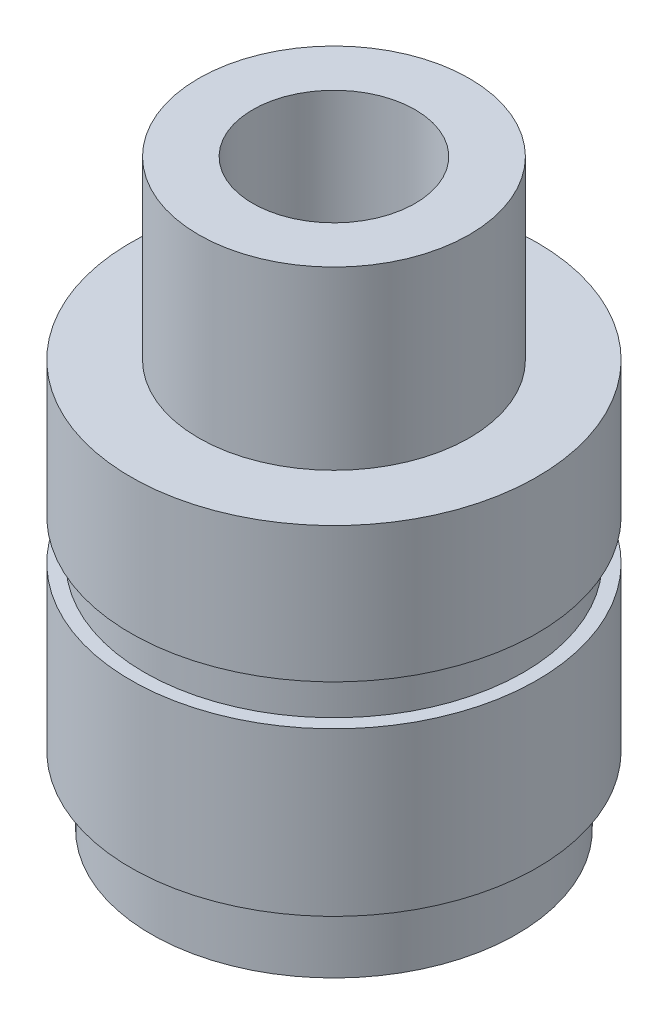
ISO-10303-21;
HEADER;
FILE_DESCRIPTION(('STEP AP214'),'2;1');
FILE_NAME('part.step','',(''),(''),'','','');
FILE_SCHEMA(('AUTOMOTIVE_DESIGN { 1 0 10303 214 1 1 1 1 }'));
ENDSEC;
DATA;
#1=APPLICATION_CONTEXT('core data for automotive mechanical design processes');
#2=APPLICATION_PROTOCOL_DEFINITION('international standard','automotive_design',2000,#1);
#3=PRODUCT_CONTEXT('',#1,'mechanical');
#4=PRODUCT('Part','Part','',(#3));
#5=PRODUCT_RELATED_PRODUCT_CATEGORY('part','',(#4));
#6=PRODUCT_DEFINITION_FORMATION('','',#4);
#7=PRODUCT_DEFINITION_CONTEXT('part definition',#1,'design');
#8=PRODUCT_DEFINITION('design','',#6,#7);
#9=PRODUCT_DEFINITION_SHAPE('','',#8);
#10=(LENGTH_UNIT() NAMED_UNIT(*) SI_UNIT(.MILLI.,.METRE.));
#11=(NAMED_UNIT(*) PLANE_ANGLE_UNIT() SI_UNIT($,.RADIAN.));
#12=(NAMED_UNIT(*) SI_UNIT($,.STERADIAN.) SOLID_ANGLE_UNIT());
#13=UNCERTAINTY_MEASURE_WITH_UNIT(LENGTH_MEASURE(1.E-05),#10,'distance_accuracy_value','');
#14=(GEOMETRIC_REPRESENTATION_CONTEXT(3) GLOBAL_UNCERTAINTY_ASSIGNED_CONTEXT((#13)) GLOBAL_UNIT_ASSIGNED_CONTEXT((#10,
#11,#12)) REPRESENTATION_CONTEXT('',''));
#15=CARTESIAN_POINT('',(0.,0.,0.));
#16=DIRECTION('',(0.,0.,1.));
#17=DIRECTION('',(1.,0.,0.));
#18=AXIS2_PLACEMENT_3D('',#15,#16,#17);
#19=CARTESIAN_POINT('',(13.5,0.,0.));
#20=DIRECTION('',(0.,-1.,0.));
#21=DIRECTION('',(0.,0.,-1.));
#22=AXIS2_PLACEMENT_3D('',#19,#20,#21);
#23=PLANE('',#22);
#24=CARTESIAN_POINT('',(0.,0.,0.));
#25=DIRECTION('',(0.,-1.,0.));
#26=DIRECTION('',(0.,0.,-1.));
#27=AXIS2_PLACEMENT_3D('',#24,#25,#26);
#28=CIRCLE('',#27,13.5);
#29=CARTESIAN_POINT('',(0.,0.,-13.5));
#30=VERTEX_POINT('',#29);
#31=EDGE_CURVE('E83',#30,#30,#28,.T.);
#32=ORIENTED_EDGE('',*,*,#31,.T.);
#33=EDGE_LOOP('',(#32));
#34=FACE_BOUND('',#33,.T.);
#35=CARTESIAN_POINT('',(0.,0.,0.));
#36=DIRECTION('',(0.,-1.,0.));
#37=DIRECTION('',(0.,0.,-1.));
#38=AXIS2_PLACEMENT_3D('',#35,#36,#37);
#39=CIRCLE('',#38,12.);
#40=CARTESIAN_POINT('',(0.,0.,-12.));
#41=VERTEX_POINT('',#40);
#42=EDGE_CURVE('E10',#41,#41,#39,.T.);
#43=ORIENTED_EDGE('',*,*,#42,.F.);
#44=EDGE_LOOP('',(#43));
#45=FACE_BOUND('',#44,.T.);
#46=ADVANCED_FACE('F37',(#34,#45),#23,.T.);
#47=CARTESIAN_POINT('',(0.,0.,0.));
#48=DIRECTION('',(0.,-1.,0.));
#49=DIRECTION('',(0.,0.,-1.));
#50=AXIS2_PLACEMENT_3D('',#47,#48,#49);
#51=CYLINDRICAL_SURFACE('',#50,12.);
#52=ORIENTED_EDGE('',*,*,#42,.T.);
#53=EDGE_LOOP('',(#52));
#54=FACE_BOUND('',#53,.T.);
#55=CARTESIAN_POINT('',(0.,25.,0.));
#56=DIRECTION('',(0.,-1.,0.));
#57=DIRECTION('',(0.,0.,-1.));
#58=AXIS2_PLACEMENT_3D('',#55,#56,#57);
#59=CIRCLE('',#58,12.);
#60=CARTESIAN_POINT('',(0.,25.,-12.));
#61=VERTEX_POINT('',#60);
#62=EDGE_CURVE('E43',#61,#61,#59,.T.);
#63=ORIENTED_EDGE('',*,*,#62,.F.);
#64=EDGE_LOOP('',(#63));
#65=FACE_BOUND('',#64,.T.);
#66=ADVANCED_FACE('F101',(#54,#65),#51,.F.);
#67=CARTESIAN_POINT('',(12.,25.,0.));
#68=DIRECTION('',(0.,-1.,0.));
#69=DIRECTION('',(0.,0.,-1.));
#70=AXIS2_PLACEMENT_3D('',#67,#68,#69);
#71=PLANE('',#70);
#72=ORIENTED_EDGE('',*,*,#62,.T.);
#73=EDGE_LOOP('',(#72));
#74=FACE_BOUND('',#73,.T.);
#75=CARTESIAN_POINT('',(0.,25.,0.));
#76=DIRECTION('',(0.,-1.,0.));
#77=DIRECTION('',(0.,0.,-1.));
#78=AXIS2_PLACEMENT_3D('',#75,#76,#77);
#79=CIRCLE('',#78,6.);
#80=CARTESIAN_POINT('',(0.,25.,-6.));
#81=VERTEX_POINT('',#80);
#82=EDGE_CURVE('E47',#81,#81,#79,.T.);
#83=ORIENTED_EDGE('',*,*,#82,.F.);
#84=EDGE_LOOP('',(#83));
#85=FACE_BOUND('',#84,.T.);
#86=ADVANCED_FACE('F105',(#74,#85),#71,.T.);
#87=CARTESIAN_POINT('',(0.,0.,0.));
#88=DIRECTION('',(0.,-1.,0.));
#89=DIRECTION('',(0.,0.,-1.));
#90=AXIS2_PLACEMENT_3D('',#87,#88,#89);
#91=CYLINDRICAL_SURFACE('',#90,6.);
#92=ORIENTED_EDGE('',*,*,#82,.T.);
#93=EDGE_LOOP('',(#92));
#94=FACE_BOUND('',#93,.T.);
#95=CARTESIAN_POINT('',(0.,43.,0.));
#96=DIRECTION('',(0.,-1.,0.));
#97=DIRECTION('',(0.,0.,-1.));
#98=AXIS2_PLACEMENT_3D('',#95,#96,#97);
#99=CIRCLE('',#98,6.);
#100=CARTESIAN_POINT('',(0.,43.,-6.));
#101=VERTEX_POINT('',#100);
#102=EDGE_CURVE('E51',#101,#101,#99,.T.);
#103=ORIENTED_EDGE('',*,*,#102,.F.);
#104=EDGE_LOOP('',(#103));
#105=FACE_BOUND('',#104,.T.);
#106=ADVANCED_FACE('F109',(#94,#105),#91,.F.);
#107=CARTESIAN_POINT('',(6.,43.,0.));
#108=DIRECTION('',(0.,1.,0.));
#109=DIRECTION('',(0.,0.,1.));
#110=AXIS2_PLACEMENT_3D('',#107,#108,#109);
#111=PLANE('',#110);
#112=ORIENTED_EDGE('',*,*,#102,.T.);
#113=EDGE_LOOP('',(#112));
#114=FACE_BOUND('',#113,.T.);
#115=CARTESIAN_POINT('',(0.,43.,0.));
#116=DIRECTION('',(0.,-1.,0.));
#117=DIRECTION('',(0.,0.,-1.));
#118=AXIS2_PLACEMENT_3D('',#115,#116,#117);
#119=CIRCLE('',#118,10.);
#120=CARTESIAN_POINT('',(0.,43.,-10.));
#121=VERTEX_POINT('',#120);
#122=EDGE_CURVE('E56',#121,#121,#119,.T.);
#123=ORIENTED_EDGE('',*,*,#122,.F.);
#124=EDGE_LOOP('',(#123));
#125=FACE_BOUND('',#124,.T.);
#126=ADVANCED_FACE('F115',(#114,#125),#111,.T.);
#127=CARTESIAN_POINT('',(0.,0.,0.));
#128=DIRECTION('',(0.,-1.,0.));
#129=DIRECTION('',(0.,0.,-1.));
#130=AXIS2_PLACEMENT_3D('',#127,#128,#129);
#131=CYLINDRICAL_SURFACE('',#130,10.);
#132=ORIENTED_EDGE('',*,*,#122,.T.);
#133=EDGE_LOOP('',(#132));
#134=FACE_BOUND('',#133,.T.);
#135=CARTESIAN_POINT('',(0.,30.,0.));
#136=DIRECTION('',(0.,-1.,0.));
#137=DIRECTION('',(0.,0.,-1.));
#138=AXIS2_PLACEMENT_3D('',#135,#136,#137);
#139=CIRCLE('',#138,10.);
#140=CARTESIAN_POINT('',(0.,30.,-10.));
#141=VERTEX_POINT('',#140);
#142=EDGE_CURVE('E59',#141,#141,#139,.T.);
#143=ORIENTED_EDGE('',*,*,#142,.F.);
#144=EDGE_LOOP('',(#143));
#145=FACE_BOUND('',#144,.T.);
#146=ADVANCED_FACE('F119',(#134,#145),#131,.T.);
#147=CARTESIAN_POINT('',(10.,30.,0.));
#148=DIRECTION('',(0.,1.,0.));
#149=DIRECTION('',(0.,0.,1.));
#150=AXIS2_PLACEMENT_3D('',#147,#148,#149);
#151=PLANE('',#150);
#152=ORIENTED_EDGE('',*,*,#142,.T.);
#153=EDGE_LOOP('',(#152));
#154=FACE_BOUND('',#153,.T.);
#155=CARTESIAN_POINT('',(0.,30.,0.));
#156=DIRECTION('',(0.,-1.,0.));
#157=DIRECTION('',(0.,0.,-1.));
#158=AXIS2_PLACEMENT_3D('',#155,#156,#157);
#159=CIRCLE('',#158,15.);
#160=CARTESIAN_POINT('',(0.,30.,-15.));
#161=VERTEX_POINT('',#160);
#162=EDGE_CURVE('E62',#161,#161,#159,.T.);
#163=ORIENTED_EDGE('',*,*,#162,.F.);
#164=EDGE_LOOP('',(#163));
#165=FACE_BOUND('',#164,.T.);
#166=ADVANCED_FACE('F123',(#154,#165),#151,.T.);
#167=CARTESIAN_POINT('',(0.,0.,0.));
#168=DIRECTION('',(0.,-1.,0.));
#169=DIRECTION('',(0.,0.,-1.));
#170=AXIS2_PLACEMENT_3D('',#167,#168,#169);
#171=CYLINDRICAL_SURFACE('',#170,15.);
#172=ORIENTED_EDGE('',*,*,#162,.T.);
#173=EDGE_LOOP('',(#172));
#174=FACE_BOUND('',#173,.T.);
#175=CARTESIAN_POINT('',(0.,20.,0.));
#176=DIRECTION('',(0.,-1.,0.));
#177=DIRECTION('',(0.,0.,-1.));
#178=AXIS2_PLACEMENT_3D('',#175,#176,#177);
#179=CIRCLE('',#178,15.);
#180=CARTESIAN_POINT('',(0.,20.,-15.));
#181=VERTEX_POINT('',#180);
#182=EDGE_CURVE('E65',#181,#181,#179,.T.);
#183=ORIENTED_EDGE('',*,*,#182,.F.);
#184=EDGE_LOOP('',(#183));
#185=FACE_BOUND('',#184,.T.);
#186=ADVANCED_FACE('F127',(#174,#185),#171,.T.);
#187=CARTESIAN_POINT('',(15.,20.,0.));
#188=DIRECTION('',(0.,-1.,0.));
#189=DIRECTION('',(0.,0.,-1.));
#190=AXIS2_PLACEMENT_3D('',#187,#188,#189);
#191=PLANE('',#190);
#192=ORIENTED_EDGE('',*,*,#182,.T.);
#193=EDGE_LOOP('',(#192));
#194=FACE_BOUND('',#193,.T.);
#195=CARTESIAN_POINT('',(0.,20.,0.));
#196=DIRECTION('',(0.,-1.,0.));
#197=DIRECTION('',(0.,0.,-1.));
#198=AXIS2_PLACEMENT_3D('',#195,#196,#197);
#199=CIRCLE('',#198,14.);
#200=CARTESIAN_POINT('',(0.,20.,-14.));
#201=VERTEX_POINT('',#200);
#202=EDGE_CURVE('E68',#201,#201,#199,.T.);
#203=ORIENTED_EDGE('',*,*,#202,.F.);
#204=EDGE_LOOP('',(#203));
#205=FACE_BOUND('',#204,.T.);
#206=ADVANCED_FACE('F131',(#194,#205),#191,.T.);
#207=CARTESIAN_POINT('',(0.,0.,0.));
#208=DIRECTION('',(0.,-1.,0.));
#209=DIRECTION('',(0.,0.,-1.));
#210=AXIS2_PLACEMENT_3D('',#207,#208,#209);
#211=CYLINDRICAL_SURFACE('',#210,14.);
#212=ORIENTED_EDGE('',*,*,#202,.T.);
#213=EDGE_LOOP('',(#212));
#214=FACE_BOUND('',#213,.T.);
#215=CARTESIAN_POINT('',(0.,17.,0.));
#216=DIRECTION('',(0.,-1.,0.));
#217=DIRECTION('',(0.,0.,-1.));
#218=AXIS2_PLACEMENT_3D('',#215,#216,#217);
#219=CIRCLE('',#218,14.);
#220=CARTESIAN_POINT('',(0.,17.,-14.));
#221=VERTEX_POINT('',#220);
#222=EDGE_CURVE('E71',#221,#221,#219,.T.);
#223=ORIENTED_EDGE('',*,*,#222,.F.);
#224=EDGE_LOOP('',(#223));
#225=FACE_BOUND('',#224,.T.);
#226=ADVANCED_FACE('F135',(#214,#225),#211,.T.);
#227=CARTESIAN_POINT('',(14.,17.,0.));
#228=DIRECTION('',(0.,1.,0.));
#229=DIRECTION('',(0.,0.,1.));
#230=AXIS2_PLACEMENT_3D('',#227,#228,#229);
#231=PLANE('',#230);
#232=ORIENTED_EDGE('',*,*,#222,.T.);
#233=EDGE_LOOP('',(#232));
#234=FACE_BOUND('',#233,.T.);
#235=CARTESIAN_POINT('',(0.,17.,0.));
#236=DIRECTION('',(0.,-1.,0.));
#237=DIRECTION('',(0.,0.,-1.));
#238=AXIS2_PLACEMENT_3D('',#235,#236,#237);
#239=CIRCLE('',#238,15.);
#240=CARTESIAN_POINT('',(0.,17.,-15.));
#241=VERTEX_POINT('',#240);
#242=EDGE_CURVE('E74',#241,#241,#239,.T.);
#243=ORIENTED_EDGE('',*,*,#242,.F.);
#244=EDGE_LOOP('',(#243));
#245=FACE_BOUND('',#244,.T.);
#246=ADVANCED_FACE('F139',(#234,#245),#231,.T.);
#247=CARTESIAN_POINT('',(0.,0.,0.));
#248=DIRECTION('',(0.,-1.,0.));
#249=DIRECTION('',(0.,0.,-1.));
#250=AXIS2_PLACEMENT_3D('',#247,#248,#249);
#251=CYLINDRICAL_SURFACE('',#250,15.);
#252=ORIENTED_EDGE('',*,*,#242,.T.);
#253=EDGE_LOOP('',(#252));
#254=FACE_BOUND('',#253,.T.);
#255=CARTESIAN_POINT('',(0.,5.,0.));
#256=DIRECTION('',(0.,-1.,0.));
#257=DIRECTION('',(0.,0.,-1.));
#258=AXIS2_PLACEMENT_3D('',#255,#256,#257);
#259=CIRCLE('',#258,15.);
#260=CARTESIAN_POINT('',(0.,5.,-15.));
#261=VERTEX_POINT('',#260);
#262=EDGE_CURVE('E77',#261,#261,#259,.T.);
#263=ORIENTED_EDGE('',*,*,#262,.F.);
#264=EDGE_LOOP('',(#263));
#265=FACE_BOUND('',#264,.T.);
#266=ADVANCED_FACE('F97',(#254,#265),#251,.T.);
#267=CARTESIAN_POINT('',(15.,5.,0.));
#268=DIRECTION('',(0.,-1.,0.));
#269=DIRECTION('',(0.,0.,-1.));
#270=AXIS2_PLACEMENT_3D('',#267,#268,#269);
#271=PLANE('',#270);
#272=ORIENTED_EDGE('',*,*,#262,.T.);
#273=EDGE_LOOP('',(#272));
#274=FACE_BOUND('',#273,.T.);
#275=CARTESIAN_POINT('',(0.,5.,0.));
#276=DIRECTION('',(0.,-1.,0.));
#277=DIRECTION('',(0.,0.,-1.));
#278=AXIS2_PLACEMENT_3D('',#275,#276,#277);
#279=CIRCLE('',#278,13.5);
#280=CARTESIAN_POINT('',(0.,5.,-13.5));
#281=VERTEX_POINT('',#280);
#282=EDGE_CURVE('E80',#281,#281,#279,.T.);
#283=ORIENTED_EDGE('',*,*,#282,.F.);
#284=EDGE_LOOP('',(#283));
#285=FACE_BOUND('',#284,.T.);
#286=ADVANCED_FACE('F91',(#274,#285),#271,.T.);
#287=CARTESIAN_POINT('',(0.,0.,0.));
#288=DIRECTION('',(0.,-1.,0.));
#289=DIRECTION('',(0.,0.,-1.));
#290=AXIS2_PLACEMENT_3D('',#287,#288,#289);
#291=CYLINDRICAL_SURFACE('',#290,13.5);
#292=ORIENTED_EDGE('',*,*,#282,.T.);
#293=EDGE_LOOP('',(#292));
#294=FACE_BOUND('',#293,.T.);
#295=ORIENTED_EDGE('',*,*,#31,.F.);
#296=EDGE_LOOP('',(#295));
#297=FACE_BOUND('',#296,.T.);
#298=ADVANCED_FACE('F89',(#294,#297),#291,.T.);
#299=CLOSED_SHELL('',(#46,#66,#86,#106,#126,#146,#166,#186,#206,#226,#246,#266,#286,#298));
#300=MANIFOLD_SOLID_BREP('B2',#299);
#301=ADVANCED_BREP_SHAPE_REPRESENTATION('',(#18,#300),#14);
#302=SHAPE_DEFINITION_REPRESENTATION(#9,#301);
ENDSEC;
END-ISO-10303-21;
